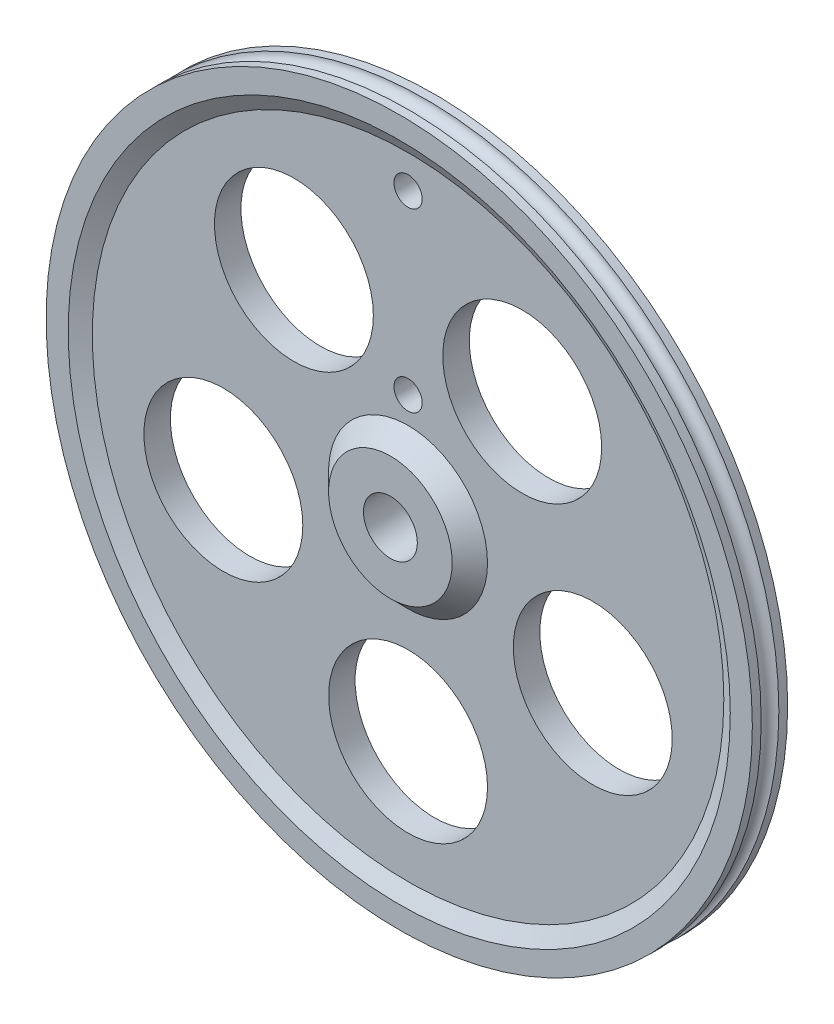
ISO-10303-21;
HEADER;
FILE_DESCRIPTION(('STEP AP214'),'2;1');
FILE_NAME('part.step','',(''),(''),'','','');
FILE_SCHEMA(('AUTOMOTIVE_DESIGN { 1 0 10303 214 1 1 1 1 }'));
ENDSEC;
DATA;
#1=APPLICATION_CONTEXT('core data for automotive mechanical design processes');
#2=APPLICATION_PROTOCOL_DEFINITION('international standard','automotive_design',2000,#1);
#3=PRODUCT_CONTEXT('',#1,'mechanical');
#4=PRODUCT('Part','Part','',(#3));
#5=PRODUCT_RELATED_PRODUCT_CATEGORY('part','',(#4));
#6=PRODUCT_DEFINITION_FORMATION('','',#4);
#7=PRODUCT_DEFINITION_CONTEXT('part definition',#1,'design');
#8=PRODUCT_DEFINITION('design','',#6,#7);
#9=PRODUCT_DEFINITION_SHAPE('','',#8);
#10=(LENGTH_UNIT() NAMED_UNIT(*) SI_UNIT(.MILLI.,.METRE.));
#11=(NAMED_UNIT(*) PLANE_ANGLE_UNIT() SI_UNIT($,.RADIAN.));
#12=(NAMED_UNIT(*) SI_UNIT($,.STERADIAN.) SOLID_ANGLE_UNIT());
#13=UNCERTAINTY_MEASURE_WITH_UNIT(LENGTH_MEASURE(1.E-05),#10,'distance_accuracy_value','');
#14=(GEOMETRIC_REPRESENTATION_CONTEXT(3) GLOBAL_UNCERTAINTY_ASSIGNED_CONTEXT((#13)) GLOBAL_UNIT_ASSIGNED_CONTEXT((#10,
#11,#12)) REPRESENTATION_CONTEXT('',''));
#15=CARTESIAN_POINT('',(0.,0.,0.));
#16=DIRECTION('',(0.,0.,1.));
#17=DIRECTION('',(1.,0.,0.));
#18=AXIS2_PLACEMENT_3D('',#15,#16,#17);
#19=CARTESIAN_POINT('',(0.,0.,3.00000000000001));
#20=DIRECTION('',(0.,0.,1.));
#21=DIRECTION('',(1.,0.,0.));
#22=AXIS2_PLACEMENT_3D('',#19,#20,#21);
#23=PLANE('',#22);
#24=CARTESIAN_POINT('',(0.,0.,3.00000000000001));
#25=DIRECTION('',(0.,0.,1.));
#26=DIRECTION('',(1.,0.,0.));
#27=AXIS2_PLACEMENT_3D('',#24,#25,#26);
#28=CIRCLE('',#27,3.05);
#29=CARTESIAN_POINT('',(3.05,0.,3.00000000000001));
#30=VERTEX_POINT('',#29);
#31=EDGE_CURVE('E65',#30,#30,#28,.T.);
#32=ORIENTED_EDGE('',*,*,#31,.F.);
#33=EDGE_LOOP('',(#32));
#34=FACE_BOUND('',#33,.T.);
#35=CARTESIAN_POINT('',(0.,0.,3.00000000000001));
#36=DIRECTION('',(0.,0.,1.));
#37=DIRECTION('',(1.,0.,0.));
#38=AXIS2_PLACEMENT_3D('',#35,#36,#37);
#39=CIRCLE('',#38,7.);
#40=CARTESIAN_POINT('',(7.,0.,3.00000000000001));
#41=VERTEX_POINT('',#40);
#42=EDGE_CURVE('E39',#41,#41,#39,.T.);
#43=ORIENTED_EDGE('',*,*,#42,.T.);
#44=EDGE_LOOP('',(#43));
#45=FACE_BOUND('',#44,.T.);
#46=ADVANCED_FACE('F32',(#34,#45),#23,.T.);
#47=CARTESIAN_POINT('',(0.,0.,0.999999999999999));
#48=DIRECTION('',(0.,0.,1.));
#49=DIRECTION('',(1.,0.,0.));
#50=AXIS2_PLACEMENT_3D('',#47,#48,#49);
#51=PLANE('',#50);
#52=CARTESIAN_POINT('',(0.,32.,0.999999999999999));
#53=DIRECTION('',(0.,0.,1.));
#54=DIRECTION('',(1.,0.,0.));
#55=AXIS2_PLACEMENT_3D('',#52,#53,#54);
#56=CIRCLE('',#55,1.6);
#57=CARTESIAN_POINT('',(1.6,32.,0.999999999999999));
#58=VERTEX_POINT('',#57);
#59=EDGE_CURVE('E106',#58,#58,#56,.T.);
#60=ORIENTED_EDGE('',*,*,#59,.F.);
#61=EDGE_LOOP('',(#60));
#62=FACE_BOUND('',#61,.T.);
#63=CARTESIAN_POINT('',(0.,12.,0.999999999999999));
#64=DIRECTION('',(0.,0.,1.));
#65=DIRECTION('',(1.,0.,0.));
#66=AXIS2_PLACEMENT_3D('',#63,#64,#65);
#67=CIRCLE('',#66,1.6);
#68=CARTESIAN_POINT('',(1.6,12.,0.999999999999999));
#69=VERTEX_POINT('',#68);
#70=EDGE_CURVE('E81',#69,#69,#67,.T.);
#71=ORIENTED_EDGE('',*,*,#70,.F.);
#72=EDGE_LOOP('',(#71));
#73=FACE_BOUND('',#72,.T.);
#74=CARTESIAN_POINT('',(-20.9232433584934,-6.79837387624879,0.999999999999999));
#75=DIRECTION('',(0.,0.,1.));
#76=DIRECTION('',(1.,0.,0.));
#77=AXIS2_PLACEMENT_3D('',#74,#75,#76);
#78=CIRCLE('',#77,9.);
#79=CARTESIAN_POINT('',(-11.9232433584934,-6.79837387624879,0.999999999999999));
#80=VERTEX_POINT('',#79);
#81=EDGE_CURVE('E96',#80,#80,#78,.T.);
#82=ORIENTED_EDGE('',*,*,#81,.F.);
#83=EDGE_LOOP('',(#82));
#84=FACE_BOUND('',#83,.T.);
#85=CARTESIAN_POINT('',(-12.9312755504343,17.7983738762489,0.999999999999999));
#86=DIRECTION('',(0.,0.,1.));
#87=DIRECTION('',(1.,0.,0.));
#88=AXIS2_PLACEMENT_3D('',#85,#86,#87);
#89=CIRCLE('',#88,9.);
#90=CARTESIAN_POINT('',(-3.93127555043431,17.7983738762489,0.999999999999999));
#91=VERTEX_POINT('',#90);
#92=EDGE_CURVE('E90',#91,#91,#89,.T.);
#93=ORIENTED_EDGE('',*,*,#92,.F.);
#94=EDGE_LOOP('',(#93));
#95=FACE_BOUND('',#94,.T.);
#96=CARTESIAN_POINT('',(12.9312755504346,17.7983738762487,0.999999999999999));
#97=DIRECTION('',(0.,0.,1.));
#98=DIRECTION('',(1.,0.,0.));
#99=AXIS2_PLACEMENT_3D('',#96,#97,#98);
#100=CIRCLE('',#99,9.);
#101=CARTESIAN_POINT('',(21.9312755504346,17.7983738762487,0.999999999999999));
#102=VERTEX_POINT('',#101);
#103=EDGE_CURVE('E84',#102,#102,#100,.T.);
#104=ORIENTED_EDGE('',*,*,#103,.F.);
#105=EDGE_LOOP('',(#104));
#106=FACE_BOUND('',#105,.T.);
#107=CARTESIAN_POINT('',(20.9232433584933,-6.79837387624908,0.999999999999999));
#108=DIRECTION('',(0.,0.,1.));
#109=DIRECTION('',(1.,0.,0.));
#110=AXIS2_PLACEMENT_3D('',#107,#108,#109);
#111=CIRCLE('',#110,9.);
#112=CARTESIAN_POINT('',(29.9232433584933,-6.79837387624908,0.999999999999999));
#113=VERTEX_POINT('',#112);
#114=EDGE_CURVE('E77',#113,#113,#111,.T.);
#115=ORIENTED_EDGE('',*,*,#114,.F.);
#116=EDGE_LOOP('',(#115));
#117=FACE_BOUND('',#116,.T.);
#118=CARTESIAN_POINT('',(0.,-22.,0.999999999999999));
#119=DIRECTION('',(0.,0.,1.));
#120=DIRECTION('',(1.,0.,0.));
#121=AXIS2_PLACEMENT_3D('',#118,#119,#120);
#122=CIRCLE('',#121,9.);
#123=CARTESIAN_POINT('',(9.,-22.,0.999999999999999));
#124=VERTEX_POINT('',#123);
#125=EDGE_CURVE('E71',#124,#124,#122,.T.);
#126=ORIENTED_EDGE('',*,*,#125,.F.);
#127=EDGE_LOOP('',(#126));
#128=FACE_BOUND('',#127,.T.);
#129=CARTESIAN_POINT('',(0.,0.,0.999999999999999));
#130=DIRECTION('',(0.,0.,1.));
#131=DIRECTION('',(1.,0.,0.));
#132=AXIS2_PLACEMENT_3D('',#129,#130,#131);
#133=CIRCLE('',#132,8.99999999999997);
#134=CARTESIAN_POINT('',(8.99999999999997,0.,0.999999999999999));
#135=VERTEX_POINT('',#134);
#136=EDGE_CURVE('E10',#135,#135,#133,.F.);
#137=ORIENTED_EDGE('',*,*,#136,.T.);
#138=EDGE_LOOP('',(#137));
#139=FACE_BOUND('',#138,.T.);
#140=CARTESIAN_POINT('',(0.,0.,0.999999999999999));
#141=DIRECTION('',(0.,0.,1.));
#142=DIRECTION('',(1.,0.,0.));
#143=AXIS2_PLACEMENT_3D('',#140,#141,#142);
#144=CIRCLE('',#143,35.7679491924311);
#145=CARTESIAN_POINT('',(35.7679491924311,0.,0.999999999999999));
#146=VERTEX_POINT('',#145);
#147=EDGE_CURVE('E43',#146,#146,#144,.T.);
#148=ORIENTED_EDGE('',*,*,#147,.T.);
#149=EDGE_LOOP('',(#148));
#150=FACE_BOUND('',#149,.T.);
#151=ADVANCED_FACE('F155',(#62,#73,#84,#95,#106,#117,#128,#139,#150),#51,.T.);
#152=CARTESIAN_POINT('',(0.,0.,0.999999999999999));
#153=DIRECTION('',(0.,0.,1.));
#154=DIRECTION('',(1.,0.,0.));
#155=AXIS2_PLACEMENT_3D('',#152,#153,#154);
#156=CONICAL_SURFACE('',#155,35.7679491924311,1.0471975511966);
#157=CARTESIAN_POINT('',(0.,0.,1.99999999999999));
#158=DIRECTION('',(0.,0.,1.));
#159=DIRECTION('',(1.,0.,0.));
#160=AXIS2_PLACEMENT_3D('',#157,#158,#159);
#161=CIRCLE('',#160,37.5);
#162=CARTESIAN_POINT('',(37.5,0.,1.99999999999999));
#163=VERTEX_POINT('',#162);
#164=EDGE_CURVE('E47',#163,#163,#161,.T.);
#165=ORIENTED_EDGE('',*,*,#164,.T.);
#166=EDGE_LOOP('',(#165));
#167=FACE_BOUND('',#166,.T.);
#168=ORIENTED_EDGE('',*,*,#147,.F.);
#169=EDGE_LOOP('',(#168));
#170=FACE_BOUND('',#169,.T.);
#171=ADVANCED_FACE('F160',(#167,#170),#156,.F.);
#172=CARTESIAN_POINT('',(0.,0.,1.99999999999999));
#173=DIRECTION('',(0.,0.,-1.));
#174=DIRECTION('',(-1.,0.,0.));
#175=AXIS2_PLACEMENT_3D('',#172,#173,#174);
#176=PLANE('',#175);
#177=ORIENTED_EDGE('',*,*,#164,.F.);
#178=EDGE_LOOP('',(#177));
#179=FACE_BOUND('',#178,.T.);
#180=CARTESIAN_POINT('',(0.,0.,2.));
#181=DIRECTION('',(0.,0.,1.));
#182=DIRECTION('',(1.,0.,0.));
#183=AXIS2_PLACEMENT_3D('',#180,#181,#182);
#184=CIRCLE('',#183,40.);
#185=CARTESIAN_POINT('',(40.,0.,2.));
#186=VERTEX_POINT('',#185);
#187=EDGE_CURVE('E52',#186,#186,#184,.T.);
#188=ORIENTED_EDGE('',*,*,#187,.T.);
#189=EDGE_LOOP('',(#188));
#190=FACE_BOUND('',#189,.T.);
#191=ADVANCED_FACE('F150',(#179,#190),#176,.F.);
#192=CARTESIAN_POINT('',(0.,0.,2.));
#193=DIRECTION('',(0.,0.,1.));
#194=DIRECTION('',(1.,0.,0.));
#195=AXIS2_PLACEMENT_3D('',#192,#193,#194);
#196=CYLINDRICAL_SURFACE('',#195,40.);
#197=CARTESIAN_POINT('',(0.,0.,0.999999999999998));
#198=DIRECTION('',(0.,0.,1.));
#199=DIRECTION('',(1.,0.,0.));
#200=AXIS2_PLACEMENT_3D('',#197,#198,#199);
#201=CIRCLE('',#200,40.);
#202=CARTESIAN_POINT('',(40.,0.,0.999999999999998));
#203=VERTEX_POINT('',#202);
#204=EDGE_CURVE('E55',#203,#203,#201,.T.);
#205=ORIENTED_EDGE('',*,*,#204,.T.);
#206=EDGE_LOOP('',(#205));
#207=FACE_BOUND('',#206,.T.);
#208=ORIENTED_EDGE('',*,*,#187,.F.);
#209=EDGE_LOOP('',(#208));
#210=FACE_BOUND('',#209,.T.);
#211=ADVANCED_FACE('F141',(#207,#210),#196,.T.);
#212=CARTESIAN_POINT('',(0.,0.,0.));
#213=DIRECTION('',(0.,0.,1.));
#214=DIRECTION('',(1.,0.,0.));
#215=AXIS2_PLACEMENT_3D('',#212,#213,#214);
#216=TOROIDAL_SURFACE('',#215,40.,0.999999999999998);
#217=ORIENTED_EDGE('',*,*,#204,.F.);
#218=EDGE_LOOP('',(#217));
#219=FACE_BOUND('',#218,.T.);
#220=CARTESIAN_POINT('',(0.,0.,-0.999999999999998));
#221=DIRECTION('',(0.,0.,1.));
#222=DIRECTION('',(1.,0.,0.));
#223=AXIS2_PLACEMENT_3D('',#220,#221,#222);
#224=CIRCLE('',#223,40.);
#225=CARTESIAN_POINT('',(40.,0.,-0.999999999999998));
#226=VERTEX_POINT('',#225);
#227=EDGE_CURVE('E58',#226,#226,#224,.T.);
#228=ORIENTED_EDGE('',*,*,#227,.T.);
#229=EDGE_LOOP('',(#228));
#230=FACE_BOUND('',#229,.T.);
#231=ADVANCED_FACE('F139',(#219,#230),#216,.F.);
#232=CARTESIAN_POINT('',(0.,0.,-1.99999999999999));
#233=DIRECTION('',(0.,0.,1.));
#234=DIRECTION('',(1.,0.,0.));
#235=AXIS2_PLACEMENT_3D('',#232,#233,#234);
#236=CIRCLE('',#235,40.);
#237=CARTESIAN_POINT('',(40.,0.,-1.99999999999999));
#238=VERTEX_POINT('',#237);
#239=EDGE_CURVE('E61',#238,#238,#236,.T.);
#240=ORIENTED_EDGE('',*,*,#239,.T.);
#241=EDGE_LOOP('',(#240));
#242=FACE_BOUND('',#241,.T.);
#243=ORIENTED_EDGE('',*,*,#227,.F.);
#244=EDGE_LOOP('',(#243));
#245=FACE_BOUND('',#244,.T.);
#246=ADVANCED_FACE('F119',(#242,#245),#196,.T.);
#247=CARTESIAN_POINT('',(0.,0.,-2.));
#248=DIRECTION('',(0.,0.,-1.));
#249=DIRECTION('',(-1.,0.,0.));
#250=AXIS2_PLACEMENT_3D('',#247,#248,#249);
#251=PLANE('',#250);
#252=CARTESIAN_POINT('',(0.,32.,-2.));
#253=DIRECTION('',(0.,0.,-1.));
#254=DIRECTION('',(-1.,0.,0.));
#255=AXIS2_PLACEMENT_3D('',#252,#253,#254);
#256=CIRCLE('',#255,1.6);
#257=CARTESIAN_POINT('',(-1.6,32.,-2.));
#258=VERTEX_POINT('',#257);
#259=EDGE_CURVE('E109',#258,#258,#256,.T.);
#260=ORIENTED_EDGE('',*,*,#259,.F.);
#261=EDGE_LOOP('',(#260));
#262=FACE_BOUND('',#261,.T.);
#263=CARTESIAN_POINT('',(0.,12.,-2.));
#264=DIRECTION('',(0.,0.,-1.));
#265=DIRECTION('',(-1.,0.,0.));
#266=AXIS2_PLACEMENT_3D('',#263,#264,#265);
#267=CIRCLE('',#266,1.6);
#268=CARTESIAN_POINT('',(-1.6,12.,-2.));
#269=VERTEX_POINT('',#268);
#270=EDGE_CURVE('E103',#269,#269,#267,.T.);
#271=ORIENTED_EDGE('',*,*,#270,.F.);
#272=EDGE_LOOP('',(#271));
#273=FACE_BOUND('',#272,.T.);
#274=CARTESIAN_POINT('',(-20.9232433584934,-6.79837387624879,-1.99999999999999));
#275=DIRECTION('',(0.,0.,1.));
#276=DIRECTION('',(1.,0.,0.));
#277=AXIS2_PLACEMENT_3D('',#274,#275,#276);
#278=CIRCLE('',#277,9.);
#279=CARTESIAN_POINT('',(-11.9232433584934,-6.79837387624879,-1.99999999999999));
#280=VERTEX_POINT('',#279);
#281=EDGE_CURVE('E74',#280,#280,#278,.T.);
#282=ORIENTED_EDGE('',*,*,#281,.T.);
#283=EDGE_LOOP('',(#282));
#284=FACE_BOUND('',#283,.T.);
#285=CARTESIAN_POINT('',(-12.9312755504343,17.7983738762489,-1.99999999999999));
#286=DIRECTION('',(0.,0.,1.));
#287=DIRECTION('',(1.,0.,0.));
#288=AXIS2_PLACEMENT_3D('',#285,#286,#287);
#289=CIRCLE('',#288,9.);
#290=CARTESIAN_POINT('',(-3.93127555043431,17.7983738762489,-1.99999999999999));
#291=VERTEX_POINT('',#290);
#292=EDGE_CURVE('E93',#291,#291,#289,.T.);
#293=ORIENTED_EDGE('',*,*,#292,.T.);
#294=EDGE_LOOP('',(#293));
#295=FACE_BOUND('',#294,.T.);
#296=CARTESIAN_POINT('',(12.9312755504346,17.7983738762487,-1.99999999999999));
#297=DIRECTION('',(0.,0.,1.));
#298=DIRECTION('',(1.,0.,0.));
#299=AXIS2_PLACEMENT_3D('',#296,#297,#298);
#300=CIRCLE('',#299,9.);
#301=CARTESIAN_POINT('',(21.9312755504346,17.7983738762487,-1.99999999999999));
#302=VERTEX_POINT('',#301);
#303=EDGE_CURVE('E87',#302,#302,#300,.T.);
#304=ORIENTED_EDGE('',*,*,#303,.T.);
#305=EDGE_LOOP('',(#304));
#306=FACE_BOUND('',#305,.T.);
#307=CARTESIAN_POINT('',(20.9232433584933,-6.79837387624908,-1.99999999999999));
#308=DIRECTION('',(0.,0.,1.));
#309=DIRECTION('',(1.,0.,0.));
#310=AXIS2_PLACEMENT_3D('',#307,#308,#309);
#311=CIRCLE('',#310,9.);
#312=CARTESIAN_POINT('',(29.9232433584933,-6.79837387624908,-1.99999999999999));
#313=VERTEX_POINT('',#312);
#314=EDGE_CURVE('E80',#313,#313,#311,.T.);
#315=ORIENTED_EDGE('',*,*,#314,.T.);
#316=EDGE_LOOP('',(#315));
#317=FACE_BOUND('',#316,.T.);
#318=CARTESIAN_POINT('',(0.,-22.,-1.99999999999999));
#319=DIRECTION('',(0.,0.,1.));
#320=DIRECTION('',(1.,0.,0.));
#321=AXIS2_PLACEMENT_3D('',#318,#319,#320);
#322=CIRCLE('',#321,9.);
#323=CARTESIAN_POINT('',(9.,-22.,-1.99999999999999));
#324=VERTEX_POINT('',#323);
#325=EDGE_CURVE('E68',#324,#324,#322,.T.);
#326=ORIENTED_EDGE('',*,*,#325,.T.);
#327=EDGE_LOOP('',(#326));
#328=FACE_BOUND('',#327,.T.);
#329=CARTESIAN_POINT('',(0.,0.,-1.99999999999999));
#330=DIRECTION('',(0.,0.,1.));
#331=DIRECTION('',(1.,0.,0.));
#332=AXIS2_PLACEMENT_3D('',#329,#330,#331);
#333=CIRCLE('',#332,3.05);
#334=CARTESIAN_POINT('',(3.05,0.,-1.99999999999999));
#335=VERTEX_POINT('',#334);
#336=EDGE_CURVE('E64',#335,#335,#333,.T.);
#337=ORIENTED_EDGE('',*,*,#336,.T.);
#338=EDGE_LOOP('',(#337));
#339=FACE_BOUND('',#338,.T.);
#340=ORIENTED_EDGE('',*,*,#239,.F.);
#341=EDGE_LOOP('',(#340));
#342=FACE_BOUND('',#341,.T.);
#343=ADVANCED_FACE('F115',(#262,#273,#284,#295,#306,#317,#328,#339,#342),#251,.T.);
#344=CARTESIAN_POINT('',(0.,0.,-1.99999999999999));
#345=DIRECTION('',(0.,0.,1.));
#346=DIRECTION('',(1.,0.,0.));
#347=AXIS2_PLACEMENT_3D('',#344,#345,#346);
#348=CYLINDRICAL_SURFACE('',#347,3.05);
#349=ORIENTED_EDGE('',*,*,#336,.F.);
#350=EDGE_LOOP('',(#349));
#351=FACE_BOUND('',#350,.T.);
#352=ORIENTED_EDGE('',*,*,#31,.T.);
#353=EDGE_LOOP('',(#352));
#354=FACE_BOUND('',#353,.T.);
#355=ADVANCED_FACE('F118',(#351,#354),#348,.F.);
#356=CARTESIAN_POINT('',(0.,0.,2.99999999999999));
#357=DIRECTION('',(0.,0.,-1.));
#358=DIRECTION('',(-1.,0.,0.));
#359=AXIS2_PLACEMENT_3D('',#356,#357,#358);
#360=CONICAL_SURFACE('',#359,7.,0.785398163397442);
#361=ORIENTED_EDGE('',*,*,#136,.F.);
#362=EDGE_LOOP('',(#361));
#363=FACE_BOUND('',#362,.T.);
#364=ORIENTED_EDGE('',*,*,#42,.F.);
#365=EDGE_LOOP('',(#364));
#366=FACE_BOUND('',#365,.T.);
#367=ADVANCED_FACE('F34',(#363,#366),#360,.T.);
#368=CARTESIAN_POINT('',(0.,-22.,-1.99999999999999));
#369=DIRECTION('',(0.,0.,1.));
#370=DIRECTION('',(1.,0.,0.));
#371=AXIS2_PLACEMENT_3D('',#368,#369,#370);
#372=CYLINDRICAL_SURFACE('',#371,9.);
#373=ORIENTED_EDGE('',*,*,#325,.F.);
#374=EDGE_LOOP('',(#373));
#375=FACE_BOUND('',#374,.T.);
#376=ORIENTED_EDGE('',*,*,#125,.T.);
#377=EDGE_LOOP('',(#376));
#378=FACE_BOUND('',#377,.T.);
#379=ADVANCED_FACE('F218',(#375,#378),#372,.F.);
#380=CARTESIAN_POINT('',(20.9232433584933,-6.79837387624908,-1.99999999999999));
#381=DIRECTION('',(0.,0.,1.));
#382=DIRECTION('',(1.,0.,0.));
#383=AXIS2_PLACEMENT_3D('',#380,#381,#382);
#384=CYLINDRICAL_SURFACE('',#383,9.);
#385=ORIENTED_EDGE('',*,*,#314,.F.);
#386=EDGE_LOOP('',(#385));
#387=FACE_BOUND('',#386,.T.);
#388=ORIENTED_EDGE('',*,*,#114,.T.);
#389=EDGE_LOOP('',(#388));
#390=FACE_BOUND('',#389,.T.);
#391=ADVANCED_FACE('F227',(#387,#390),#384,.F.);
#392=CARTESIAN_POINT('',(12.9312755504346,17.7983738762487,-1.99999999999999));
#393=DIRECTION('',(0.,0.,1.));
#394=DIRECTION('',(1.,0.,0.));
#395=AXIS2_PLACEMENT_3D('',#392,#393,#394);
#396=CYLINDRICAL_SURFACE('',#395,9.);
#397=ORIENTED_EDGE('',*,*,#303,.F.);
#398=EDGE_LOOP('',(#397));
#399=FACE_BOUND('',#398,.T.);
#400=ORIENTED_EDGE('',*,*,#103,.T.);
#401=EDGE_LOOP('',(#400));
#402=FACE_BOUND('',#401,.T.);
#403=ADVANCED_FACE('F237',(#399,#402),#396,.F.);
#404=CARTESIAN_POINT('',(-12.9312755504343,17.7983738762489,-1.99999999999999));
#405=DIRECTION('',(0.,0.,1.));
#406=DIRECTION('',(1.,0.,0.));
#407=AXIS2_PLACEMENT_3D('',#404,#405,#406);
#408=CYLINDRICAL_SURFACE('',#407,9.);
#409=ORIENTED_EDGE('',*,*,#292,.F.);
#410=EDGE_LOOP('',(#409));
#411=FACE_BOUND('',#410,.T.);
#412=ORIENTED_EDGE('',*,*,#92,.T.);
#413=EDGE_LOOP('',(#412));
#414=FACE_BOUND('',#413,.T.);
#415=ADVANCED_FACE('F247',(#411,#414),#408,.F.);
#416=CARTESIAN_POINT('',(-20.9232433584934,-6.79837387624879,-1.99999999999999));
#417=DIRECTION('',(0.,0.,1.));
#418=DIRECTION('',(1.,0.,0.));
#419=AXIS2_PLACEMENT_3D('',#416,#417,#418);
#420=CYLINDRICAL_SURFACE('',#419,9.);
#421=ORIENTED_EDGE('',*,*,#281,.F.);
#422=EDGE_LOOP('',(#421));
#423=FACE_BOUND('',#422,.T.);
#424=ORIENTED_EDGE('',*,*,#81,.T.);
#425=EDGE_LOOP('',(#424));
#426=FACE_BOUND('',#425,.T.);
#427=ADVANCED_FACE('F257',(#423,#426),#420,.F.);
#428=CARTESIAN_POINT('',(0.,12.,3.00000000000001));
#429=DIRECTION('',(0.,0.,-1.));
#430=DIRECTION('',(-1.,0.,0.));
#431=AXIS2_PLACEMENT_3D('',#428,#429,#430);
#432=CYLINDRICAL_SURFACE('',#431,1.6);
#433=ORIENTED_EDGE('',*,*,#70,.T.);
#434=EDGE_LOOP('',(#433));
#435=FACE_BOUND('',#434,.T.);
#436=ORIENTED_EDGE('',*,*,#270,.T.);
#437=EDGE_LOOP('',(#436));
#438=FACE_BOUND('',#437,.T.);
#439=ADVANCED_FACE('F267',(#435,#438),#432,.F.);
#440=CARTESIAN_POINT('',(0.,32.,3.00000000000001));
#441=DIRECTION('',(0.,0.,-1.));
#442=DIRECTION('',(-1.,0.,0.));
#443=AXIS2_PLACEMENT_3D('',#440,#441,#442);
#444=CYLINDRICAL_SURFACE('',#443,1.6);
#445=ORIENTED_EDGE('',*,*,#59,.T.);
#446=EDGE_LOOP('',(#445));
#447=FACE_BOUND('',#446,.T.);
#448=ORIENTED_EDGE('',*,*,#259,.T.);
#449=EDGE_LOOP('',(#448));
#450=FACE_BOUND('',#449,.T.);
#451=ADVANCED_FACE('F113',(#447,#450),#444,.F.);
#452=CLOSED_SHELL('',(#46,#151,#171,#191,#211,#231,#246,#343,#355,#367,#379,#391,#403,#415,#427,
#439,#451));
#453=MANIFOLD_SOLID_BREP('B2',#452);
#454=ADVANCED_BREP_SHAPE_REPRESENTATION('',(#18,#453),#14);
#455=SHAPE_DEFINITION_REPRESENTATION(#9,#454);
ENDSEC;
END-ISO-10303-21;
